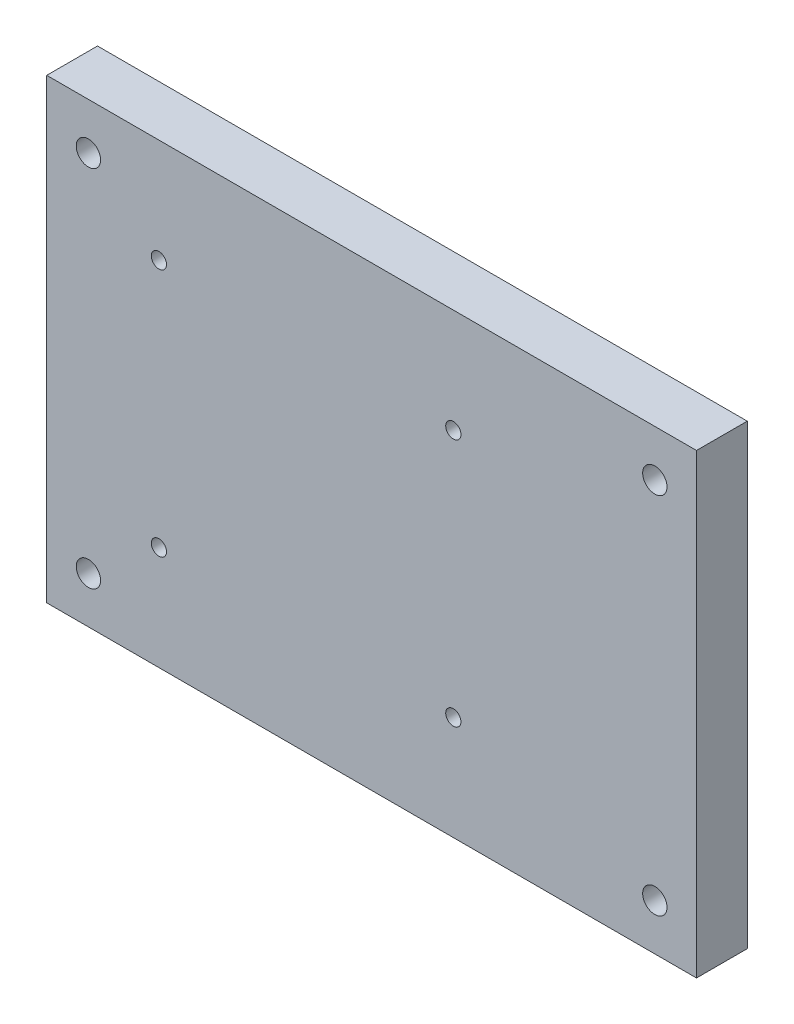
ISO-10303-21;
HEADER;
FILE_DESCRIPTION(('STEP AP214'),'2;1');
FILE_NAME('part.step','',(''),(''),'','','');
FILE_SCHEMA(('AUTOMOTIVE_DESIGN { 1 0 10303 214 1 1 1 1 }'));
ENDSEC;
DATA;
#1=APPLICATION_CONTEXT('core data for automotive mechanical design processes');
#2=APPLICATION_PROTOCOL_DEFINITION('international standard','automotive_design',2000,#1);
#3=PRODUCT_CONTEXT('',#1,'mechanical');
#4=PRODUCT('Part','Part','',(#3));
#5=PRODUCT_RELATED_PRODUCT_CATEGORY('part','',(#4));
#6=PRODUCT_DEFINITION_FORMATION('','',#4);
#7=PRODUCT_DEFINITION_CONTEXT('part definition',#1,'design');
#8=PRODUCT_DEFINITION('design','',#6,#7);
#9=PRODUCT_DEFINITION_SHAPE('','',#8);
#10=(LENGTH_UNIT() NAMED_UNIT(*) SI_UNIT(.MILLI.,.METRE.));
#11=(NAMED_UNIT(*) PLANE_ANGLE_UNIT() SI_UNIT($,.RADIAN.));
#12=(NAMED_UNIT(*) SI_UNIT($,.STERADIAN.) SOLID_ANGLE_UNIT());
#13=UNCERTAINTY_MEASURE_WITH_UNIT(LENGTH_MEASURE(1.E-05),#10,'distance_accuracy_value','');
#14=(GEOMETRIC_REPRESENTATION_CONTEXT(3) GLOBAL_UNCERTAINTY_ASSIGNED_CONTEXT((#13)) GLOBAL_UNIT_ASSIGNED_CONTEXT((#10,
#11,#12)) REPRESENTATION_CONTEXT('',''));
#15=CARTESIAN_POINT('',(0.,0.,0.));
#16=DIRECTION('',(0.,0.,1.));
#17=DIRECTION('',(1.,0.,0.));
#18=AXIS2_PLACEMENT_3D('',#15,#16,#17);
#19=CARTESIAN_POINT('',(0.,0.,10.));
#20=DIRECTION('',(0.,0.,1.));
#21=DIRECTION('',(1.,0.,0.));
#22=AXIS2_PLACEMENT_3D('',#19,#20,#21);
#23=PLANE('',#22);
#24=CARTESIAN_POINT('',(-39.6943758039658,11.375,10.));
#25=DIRECTION('',(0.,0.,1.));
#26=DIRECTION('',(1.,0.,0.));
#27=AXIS2_PLACEMENT_3D('',#24,#25,#26);
#28=CIRCLE('',#27,1.5);
#29=CARTESIAN_POINT('',(-38.1943758039658,11.375,10.));
#30=VERTEX_POINT('',#29);
#31=EDGE_CURVE('E145',#30,#30,#28,.T.);
#32=ORIENTED_EDGE('',*,*,#31,.F.);
#33=EDGE_LOOP('',(#32));
#34=FACE_BOUND('',#33,.T.);
#35=CARTESIAN_POINT('',(-97.6943758039659,60.375,10.));
#36=DIRECTION('',(0.,0.,1.));
#37=DIRECTION('',(1.,0.,0.));
#38=AXIS2_PLACEMENT_3D('',#35,#36,#37);
#39=CIRCLE('',#38,1.5);
#40=CARTESIAN_POINT('',(-96.1943758039659,60.375,10.));
#41=VERTEX_POINT('',#40);
#42=EDGE_CURVE('E133',#41,#41,#39,.T.);
#43=ORIENTED_EDGE('',*,*,#42,.F.);
#44=EDGE_LOOP('',(#43));
#45=FACE_BOUND('',#44,.T.);
#46=CARTESIAN_POINT('',(0.,0.,10.));
#47=DIRECTION('',(0.,0.,1.));
#48=DIRECTION('',(1.,0.,0.));
#49=AXIS2_PLACEMENT_3D('',#46,#47,#48);
#50=CIRCLE('',#49,2.4);
#51=CARTESIAN_POINT('',(2.4,0.,10.));
#52=VERTEX_POINT('',#51);
#53=EDGE_CURVE('E121',#52,#52,#50,.T.);
#54=ORIENTED_EDGE('',*,*,#53,.F.);
#55=EDGE_LOOP('',(#54));
#56=FACE_BOUND('',#55,.T.);
#57=CARTESIAN_POINT('',(0.,71.73,10.));
#58=DIRECTION('',(0.,0.,1.));
#59=DIRECTION('',(1.,0.,0.));
#60=AXIS2_PLACEMENT_3D('',#57,#58,#59);
#61=CIRCLE('',#60,2.4);
#62=CARTESIAN_POINT('',(2.4,71.73,10.));
#63=VERTEX_POINT('',#62);
#64=EDGE_CURVE('E100',#63,#63,#61,.T.);
#65=ORIENTED_EDGE('',*,*,#64,.F.);
#66=EDGE_LOOP('',(#65));
#67=FACE_BOUND('',#66,.T.);
#68=DIRECTION('',(0.,-1.,0.));
#69=VECTOR('',#68,1.);
#70=CARTESIAN_POINT('',(-119.79,80.875,10.));
#71=LINE('',#70,#69);
#72=CARTESIAN_POINT('',(-119.79,80.875,10.));
#73=VERTEX_POINT('',#72);
#74=CARTESIAN_POINT('',(-119.79,-9.12500000000001,10.));
#75=VERTEX_POINT('',#74);
#76=EDGE_CURVE('E85',#73,#75,#71,.T.);
#77=ORIENTED_EDGE('',*,*,#76,.T.);
#78=DIRECTION('',(1.,0.,0.));
#79=VECTOR('',#78,1.);
#80=CARTESIAN_POINT('',(-119.79,-9.12500000000001,10.));
#81=LINE('',#80,#79);
#82=CARTESIAN_POINT('',(8.21000000000001,-9.12500000000001,10.));
#83=VERTEX_POINT('',#82);
#84=EDGE_CURVE('E80',#75,#83,#81,.T.);
#85=ORIENTED_EDGE('',*,*,#84,.T.);
#86=DIRECTION('',(0.,1.,0.));
#87=VECTOR('',#86,1.);
#88=CARTESIAN_POINT('',(8.21,80.875,10.));
#89=LINE('',#88,#87);
#90=CARTESIAN_POINT('',(8.21,80.875,10.));
#91=VERTEX_POINT('',#90);
#92=EDGE_CURVE('E83',#83,#91,#89,.T.);
#93=ORIENTED_EDGE('',*,*,#92,.T.);
#94=DIRECTION('',(-1.,0.,0.));
#95=VECTOR('',#94,1.);
#96=CARTESIAN_POINT('',(-119.79,80.875,10.));
#97=LINE('',#96,#95);
#98=EDGE_CURVE('E50',#91,#73,#97,.T.);
#99=ORIENTED_EDGE('',*,*,#98,.T.);
#100=EDGE_LOOP('',(#77,#85,#93,#99));
#101=FACE_BOUND('',#100,.T.);
#102=CARTESIAN_POINT('',(-111.58,0.,10.));
#103=DIRECTION('',(0.,0.,1.));
#104=DIRECTION('',(1.,0.,0.));
#105=AXIS2_PLACEMENT_3D('',#102,#103,#104);
#106=CIRCLE('',#105,2.40000000000001);
#107=CARTESIAN_POINT('',(-109.18,0.,10.));
#108=VERTEX_POINT('',#107);
#109=EDGE_CURVE('E115',#108,#108,#106,.T.);
#110=ORIENTED_EDGE('',*,*,#109,.F.);
#111=EDGE_LOOP('',(#110));
#112=FACE_BOUND('',#111,.T.);
#113=CARTESIAN_POINT('',(-111.58,71.73,10.));
#114=DIRECTION('',(0.,0.,1.));
#115=DIRECTION('',(1.,0.,0.));
#116=AXIS2_PLACEMENT_3D('',#113,#114,#115);
#117=CIRCLE('',#116,2.4);
#118=CARTESIAN_POINT('',(-109.18,71.73,10.));
#119=VERTEX_POINT('',#118);
#120=EDGE_CURVE('E127',#119,#119,#117,.T.);
#121=ORIENTED_EDGE('',*,*,#120,.F.);
#122=EDGE_LOOP('',(#121));
#123=FACE_BOUND('',#122,.T.);
#124=CARTESIAN_POINT('',(-39.6943758039658,60.375,10.));
#125=DIRECTION('',(0.,0.,1.));
#126=DIRECTION('',(1.,0.,0.));
#127=AXIS2_PLACEMENT_3D('',#124,#125,#126);
#128=CIRCLE('',#127,1.5);
#129=CARTESIAN_POINT('',(-38.1943758039658,60.375,10.));
#130=VERTEX_POINT('',#129);
#131=EDGE_CURVE('E139',#130,#130,#128,.T.);
#132=ORIENTED_EDGE('',*,*,#131,.F.);
#133=EDGE_LOOP('',(#132));
#134=FACE_BOUND('',#133,.T.);
#135=CARTESIAN_POINT('',(-97.6943758039659,11.375,10.));
#136=DIRECTION('',(0.,0.,1.));
#137=DIRECTION('',(1.,0.,0.));
#138=AXIS2_PLACEMENT_3D('',#135,#136,#137);
#139=CIRCLE('',#138,1.5);
#140=CARTESIAN_POINT('',(-96.1943758039659,11.375,10.));
#141=VERTEX_POINT('',#140);
#142=EDGE_CURVE('E151',#141,#141,#139,.T.);
#143=ORIENTED_EDGE('',*,*,#142,.F.);
#144=EDGE_LOOP('',(#143));
#145=FACE_BOUND('',#144,.T.);
#146=ADVANCED_FACE('F33',(#34,#45,#56,#67,#101,#112,#123,#134,#145),#23,.T.);
#147=CARTESIAN_POINT('',(0.,0.,0.));
#148=DIRECTION('',(0.,0.,1.));
#149=DIRECTION('',(1.,0.,0.));
#150=AXIS2_PLACEMENT_3D('',#147,#148,#149);
#151=PLANE('',#150);
#152=DIRECTION('',(0.,-1.,0.));
#153=VECTOR('',#152,1.);
#154=CARTESIAN_POINT('',(-119.79,80.875,0.));
#155=LINE('',#154,#153);
#156=CARTESIAN_POINT('',(-119.79,80.875,0.));
#157=VERTEX_POINT('',#156);
#158=CARTESIAN_POINT('',(-119.79,-9.12500000000001,0.));
#159=VERTEX_POINT('',#158);
#160=EDGE_CURVE('E97',#157,#159,#155,.T.);
#161=ORIENTED_EDGE('',*,*,#160,.F.);
#162=DIRECTION('',(-1.,0.,0.));
#163=VECTOR('',#162,1.);
#164=CARTESIAN_POINT('',(-119.79,80.875,0.));
#165=LINE('',#164,#163);
#166=CARTESIAN_POINT('',(8.21,80.875,0.));
#167=VERTEX_POINT('',#166);
#168=EDGE_CURVE('E73',#167,#157,#165,.T.);
#169=ORIENTED_EDGE('',*,*,#168,.F.);
#170=DIRECTION('',(0.,1.,0.));
#171=VECTOR('',#170,1.);
#172=CARTESIAN_POINT('',(8.21,80.875,0.));
#173=LINE('',#172,#171);
#174=CARTESIAN_POINT('',(8.21000000000001,-9.12500000000001,0.));
#175=VERTEX_POINT('',#174);
#176=EDGE_CURVE('E67',#175,#167,#173,.T.);
#177=ORIENTED_EDGE('',*,*,#176,.F.);
#178=DIRECTION('',(1.,0.,0.));
#179=VECTOR('',#178,1.);
#180=CARTESIAN_POINT('',(-119.79,-9.12500000000001,0.));
#181=LINE('',#180,#179);
#182=EDGE_CURVE('E89',#159,#175,#181,.T.);
#183=ORIENTED_EDGE('',*,*,#182,.F.);
#184=EDGE_LOOP('',(#161,#169,#177,#183));
#185=FACE_BOUND('',#184,.T.);
#186=CARTESIAN_POINT('',(0.,71.73,0.));
#187=DIRECTION('',(0.,0.,1.));
#188=DIRECTION('',(1.,0.,0.));
#189=AXIS2_PLACEMENT_3D('',#186,#187,#188);
#190=CIRCLE('',#189,2.4);
#191=CARTESIAN_POINT('',(2.4,71.73,0.));
#192=VERTEX_POINT('',#191);
#193=EDGE_CURVE('E112',#192,#192,#190,.T.);
#194=ORIENTED_EDGE('',*,*,#193,.T.);
#195=EDGE_LOOP('',(#194));
#196=FACE_BOUND('',#195,.T.);
#197=CARTESIAN_POINT('',(-111.58,0.,0.));
#198=DIRECTION('',(0.,0.,1.));
#199=DIRECTION('',(1.,0.,0.));
#200=AXIS2_PLACEMENT_3D('',#197,#198,#199);
#201=CIRCLE('',#200,2.40000000000001);
#202=CARTESIAN_POINT('',(-109.18,0.,0.));
#203=VERTEX_POINT('',#202);
#204=EDGE_CURVE('E118',#203,#203,#201,.T.);
#205=ORIENTED_EDGE('',*,*,#204,.T.);
#206=EDGE_LOOP('',(#205));
#207=FACE_BOUND('',#206,.T.);
#208=CARTESIAN_POINT('',(0.,0.,0.));
#209=DIRECTION('',(0.,0.,1.));
#210=DIRECTION('',(1.,0.,0.));
#211=AXIS2_PLACEMENT_3D('',#208,#209,#210);
#212=CIRCLE('',#211,2.4);
#213=CARTESIAN_POINT('',(2.4,0.,0.));
#214=VERTEX_POINT('',#213);
#215=EDGE_CURVE('E124',#214,#214,#212,.T.);
#216=ORIENTED_EDGE('',*,*,#215,.T.);
#217=EDGE_LOOP('',(#216));
#218=FACE_BOUND('',#217,.T.);
#219=CARTESIAN_POINT('',(-111.58,71.73,0.));
#220=DIRECTION('',(0.,0.,1.));
#221=DIRECTION('',(1.,0.,0.));
#222=AXIS2_PLACEMENT_3D('',#219,#220,#221);
#223=CIRCLE('',#222,2.4);
#224=CARTESIAN_POINT('',(-109.18,71.73,0.));
#225=VERTEX_POINT('',#224);
#226=EDGE_CURVE('E130',#225,#225,#223,.T.);
#227=ORIENTED_EDGE('',*,*,#226,.T.);
#228=EDGE_LOOP('',(#227));
#229=FACE_BOUND('',#228,.T.);
#230=CARTESIAN_POINT('',(-97.6943758039659,60.375,0.));
#231=DIRECTION('',(0.,0.,1.));
#232=DIRECTION('',(1.,0.,0.));
#233=AXIS2_PLACEMENT_3D('',#230,#231,#232);
#234=CIRCLE('',#233,1.5);
#235=CARTESIAN_POINT('',(-96.1943758039659,60.375,0.));
#236=VERTEX_POINT('',#235);
#237=EDGE_CURVE('E136',#236,#236,#234,.T.);
#238=ORIENTED_EDGE('',*,*,#237,.T.);
#239=EDGE_LOOP('',(#238));
#240=FACE_BOUND('',#239,.T.);
#241=CARTESIAN_POINT('',(-39.6943758039658,60.375,0.));
#242=DIRECTION('',(0.,0.,1.));
#243=DIRECTION('',(1.,0.,0.));
#244=AXIS2_PLACEMENT_3D('',#241,#242,#243);
#245=CIRCLE('',#244,1.5);
#246=CARTESIAN_POINT('',(-38.1943758039658,60.375,0.));
#247=VERTEX_POINT('',#246);
#248=EDGE_CURVE('E142',#247,#247,#245,.T.);
#249=ORIENTED_EDGE('',*,*,#248,.T.);
#250=EDGE_LOOP('',(#249));
#251=FACE_BOUND('',#250,.T.);
#252=CARTESIAN_POINT('',(-39.6943758039658,11.375,0.));
#253=DIRECTION('',(0.,0.,1.));
#254=DIRECTION('',(1.,0.,0.));
#255=AXIS2_PLACEMENT_3D('',#252,#253,#254);
#256=CIRCLE('',#255,1.5);
#257=CARTESIAN_POINT('',(-38.1943758039658,11.375,0.));
#258=VERTEX_POINT('',#257);
#259=EDGE_CURVE('E148',#258,#258,#256,.T.);
#260=ORIENTED_EDGE('',*,*,#259,.T.);
#261=EDGE_LOOP('',(#260));
#262=FACE_BOUND('',#261,.T.);
#263=CARTESIAN_POINT('',(-97.6943758039659,11.375,0.));
#264=DIRECTION('',(0.,0.,1.));
#265=DIRECTION('',(1.,0.,0.));
#266=AXIS2_PLACEMENT_3D('',#263,#264,#265);
#267=CIRCLE('',#266,1.5);
#268=CARTESIAN_POINT('',(-96.1943758039659,11.375,0.));
#269=VERTEX_POINT('',#268);
#270=EDGE_CURVE('E154',#269,#269,#267,.T.);
#271=ORIENTED_EDGE('',*,*,#270,.T.);
#272=EDGE_LOOP('',(#271));
#273=FACE_BOUND('',#272,.T.);
#274=ADVANCED_FACE('F108',(#185,#196,#207,#218,#229,#240,#251,#262,#273),#151,.F.);
#275=CARTESIAN_POINT('',(-119.79,80.875,10.));
#276=DIRECTION('',(1.,0.,0.));
#277=DIRECTION('',(0.,1.,0.));
#278=AXIS2_PLACEMENT_3D('',#275,#276,#277);
#279=PLANE('',#278);
#280=ORIENTED_EDGE('',*,*,#160,.T.);
#281=DIRECTION('',(0.,0.,-1.));
#282=VECTOR('',#281,1.);
#283=CARTESIAN_POINT('',(-119.79,-9.12500000000001,10.));
#284=LINE('',#283,#282);
#285=EDGE_CURVE('E11',#75,#159,#284,.T.);
#286=ORIENTED_EDGE('',*,*,#285,.F.);
#287=ORIENTED_EDGE('',*,*,#76,.F.);
#288=DIRECTION('',(0.,0.,-1.));
#289=VECTOR('',#288,1.);
#290=CARTESIAN_POINT('',(-119.79,80.875,10.));
#291=LINE('',#290,#289);
#292=EDGE_CURVE('E93',#73,#157,#291,.T.);
#293=ORIENTED_EDGE('',*,*,#292,.T.);
#294=EDGE_LOOP('',(#280,#286,#287,#293));
#295=FACE_BOUND('',#294,.T.);
#296=ADVANCED_FACE('F35',(#295),#279,.F.);
#297=CARTESIAN_POINT('',(-119.79,-9.12500000000001,10.));
#298=DIRECTION('',(0.,1.,0.));
#299=DIRECTION('',(0.,0.,1.));
#300=AXIS2_PLACEMENT_3D('',#297,#298,#299);
#301=PLANE('',#300);
#302=ORIENTED_EDGE('',*,*,#182,.T.);
#303=DIRECTION('',(0.,0.,-1.));
#304=VECTOR('',#303,1.);
#305=CARTESIAN_POINT('',(8.21000000000001,-9.12500000000001,10.));
#306=LINE('',#305,#304);
#307=EDGE_CURVE('E42',#83,#175,#306,.T.);
#308=ORIENTED_EDGE('',*,*,#307,.F.);
#309=ORIENTED_EDGE('',*,*,#84,.F.);
#310=ORIENTED_EDGE('',*,*,#285,.T.);
#311=EDGE_LOOP('',(#302,#308,#309,#310));
#312=FACE_BOUND('',#311,.T.);
#313=ADVANCED_FACE('F88',(#312),#301,.F.);
#314=CARTESIAN_POINT('',(8.21,80.875,10.));
#315=DIRECTION('',(-1.,0.,0.));
#316=DIRECTION('',(0.,-1.,0.));
#317=AXIS2_PLACEMENT_3D('',#314,#315,#316);
#318=PLANE('',#317);
#319=ORIENTED_EDGE('',*,*,#176,.T.);
#320=DIRECTION('',(0.,0.,-1.));
#321=VECTOR('',#320,1.);
#322=CARTESIAN_POINT('',(8.21,80.875,10.));
#323=LINE('',#322,#321);
#324=EDGE_CURVE('E90',#91,#167,#323,.T.);
#325=ORIENTED_EDGE('',*,*,#324,.F.);
#326=ORIENTED_EDGE('',*,*,#92,.F.);
#327=ORIENTED_EDGE('',*,*,#307,.T.);
#328=EDGE_LOOP('',(#319,#325,#326,#327));
#329=FACE_BOUND('',#328,.T.);
#330=ADVANCED_FACE('F91',(#329),#318,.F.);
#331=CARTESIAN_POINT('',(-119.79,80.875,10.));
#332=DIRECTION('',(0.,-1.,0.));
#333=DIRECTION('',(0.,0.,-1.));
#334=AXIS2_PLACEMENT_3D('',#331,#332,#333);
#335=PLANE('',#334);
#336=ORIENTED_EDGE('',*,*,#168,.T.);
#337=ORIENTED_EDGE('',*,*,#292,.F.);
#338=ORIENTED_EDGE('',*,*,#98,.F.);
#339=ORIENTED_EDGE('',*,*,#324,.T.);
#340=EDGE_LOOP('',(#336,#337,#338,#339));
#341=FACE_BOUND('',#340,.T.);
#342=ADVANCED_FACE('F105',(#341),#335,.F.);
#343=CARTESIAN_POINT('',(0.,71.73,10.));
#344=DIRECTION('',(0.,0.,-1.));
#345=DIRECTION('',(-1.,0.,0.));
#346=AXIS2_PLACEMENT_3D('',#343,#344,#345);
#347=CYLINDRICAL_SURFACE('',#346,2.4);
#348=ORIENTED_EDGE('',*,*,#64,.T.);
#349=EDGE_LOOP('',(#348));
#350=FACE_BOUND('',#349,.T.);
#351=ORIENTED_EDGE('',*,*,#193,.F.);
#352=EDGE_LOOP('',(#351));
#353=FACE_BOUND('',#352,.T.);
#354=ADVANCED_FACE('F173',(#350,#353),#347,.F.);
#355=CARTESIAN_POINT('',(-111.58,0.,10.));
#356=DIRECTION('',(0.,0.,-1.));
#357=DIRECTION('',(-1.,0.,0.));
#358=AXIS2_PLACEMENT_3D('',#355,#356,#357);
#359=CYLINDRICAL_SURFACE('',#358,2.40000000000001);
#360=ORIENTED_EDGE('',*,*,#109,.T.);
#361=EDGE_LOOP('',(#360));
#362=FACE_BOUND('',#361,.T.);
#363=ORIENTED_EDGE('',*,*,#204,.F.);
#364=EDGE_LOOP('',(#363));
#365=FACE_BOUND('',#364,.T.);
#366=ADVANCED_FACE('F219',(#362,#365),#359,.F.);
#367=CARTESIAN_POINT('',(0.,0.,10.));
#368=DIRECTION('',(0.,0.,-1.));
#369=DIRECTION('',(-1.,0.,0.));
#370=AXIS2_PLACEMENT_3D('',#367,#368,#369);
#371=CYLINDRICAL_SURFACE('',#370,2.4);
#372=ORIENTED_EDGE('',*,*,#53,.T.);
#373=EDGE_LOOP('',(#372));
#374=FACE_BOUND('',#373,.T.);
#375=ORIENTED_EDGE('',*,*,#215,.F.);
#376=EDGE_LOOP('',(#375));
#377=FACE_BOUND('',#376,.T.);
#378=ADVANCED_FACE('F227',(#374,#377),#371,.F.);
#379=CARTESIAN_POINT('',(-111.58,71.73,10.));
#380=DIRECTION('',(0.,0.,-1.));
#381=DIRECTION('',(-1.,0.,0.));
#382=AXIS2_PLACEMENT_3D('',#379,#380,#381);
#383=CYLINDRICAL_SURFACE('',#382,2.4);
#384=ORIENTED_EDGE('',*,*,#120,.T.);
#385=EDGE_LOOP('',(#384));
#386=FACE_BOUND('',#385,.T.);
#387=ORIENTED_EDGE('',*,*,#226,.F.);
#388=EDGE_LOOP('',(#387));
#389=FACE_BOUND('',#388,.T.);
#390=ADVANCED_FACE('F235',(#386,#389),#383,.F.);
#391=CARTESIAN_POINT('',(-97.6943758039659,60.375,10.));
#392=DIRECTION('',(0.,0.,-1.));
#393=DIRECTION('',(-1.,0.,0.));
#394=AXIS2_PLACEMENT_3D('',#391,#392,#393);
#395=CYLINDRICAL_SURFACE('',#394,1.5);
#396=ORIENTED_EDGE('',*,*,#42,.T.);
#397=EDGE_LOOP('',(#396));
#398=FACE_BOUND('',#397,.T.);
#399=ORIENTED_EDGE('',*,*,#237,.F.);
#400=EDGE_LOOP('',(#399));
#401=FACE_BOUND('',#400,.T.);
#402=ADVANCED_FACE('F244',(#398,#401),#395,.F.);
#403=CARTESIAN_POINT('',(-39.6943758039658,60.375,10.));
#404=DIRECTION('',(0.,0.,-1.));
#405=DIRECTION('',(-1.,0.,0.));
#406=AXIS2_PLACEMENT_3D('',#403,#404,#405);
#407=CYLINDRICAL_SURFACE('',#406,1.5);
#408=ORIENTED_EDGE('',*,*,#131,.T.);
#409=EDGE_LOOP('',(#408));
#410=FACE_BOUND('',#409,.T.);
#411=ORIENTED_EDGE('',*,*,#248,.F.);
#412=EDGE_LOOP('',(#411));
#413=FACE_BOUND('',#412,.T.);
#414=ADVANCED_FACE('F253',(#410,#413),#407,.F.);
#415=CARTESIAN_POINT('',(-39.6943758039658,11.375,10.));
#416=DIRECTION('',(0.,0.,-1.));
#417=DIRECTION('',(-1.,0.,0.));
#418=AXIS2_PLACEMENT_3D('',#415,#416,#417);
#419=CYLINDRICAL_SURFACE('',#418,1.5);
#420=ORIENTED_EDGE('',*,*,#31,.T.);
#421=EDGE_LOOP('',(#420));
#422=FACE_BOUND('',#421,.T.);
#423=ORIENTED_EDGE('',*,*,#259,.F.);
#424=EDGE_LOOP('',(#423));
#425=FACE_BOUND('',#424,.T.);
#426=ADVANCED_FACE('F262',(#422,#425),#419,.F.);
#427=CARTESIAN_POINT('',(-97.6943758039659,11.375,10.));
#428=DIRECTION('',(0.,0.,-1.));
#429=DIRECTION('',(-1.,0.,0.));
#430=AXIS2_PLACEMENT_3D('',#427,#428,#429);
#431=CYLINDRICAL_SURFACE('',#430,1.5);
#432=ORIENTED_EDGE('',*,*,#142,.T.);
#433=EDGE_LOOP('',(#432));
#434=FACE_BOUND('',#433,.T.);
#435=ORIENTED_EDGE('',*,*,#270,.F.);
#436=EDGE_LOOP('',(#435));
#437=FACE_BOUND('',#436,.T.);
#438=ADVANCED_FACE('F160',(#434,#437),#431,.F.);
#439=CLOSED_SHELL('',(#146,#274,#296,#313,#330,#342,#354,#366,#378,#390,#402,#414,#426,#438));
#440=MANIFOLD_SOLID_BREP('B2',#439);
#441=ADVANCED_BREP_SHAPE_REPRESENTATION('',(#18,#440),#14);
#442=SHAPE_DEFINITION_REPRESENTATION(#9,#441);
ENDSEC;
END-ISO-10303-21;
